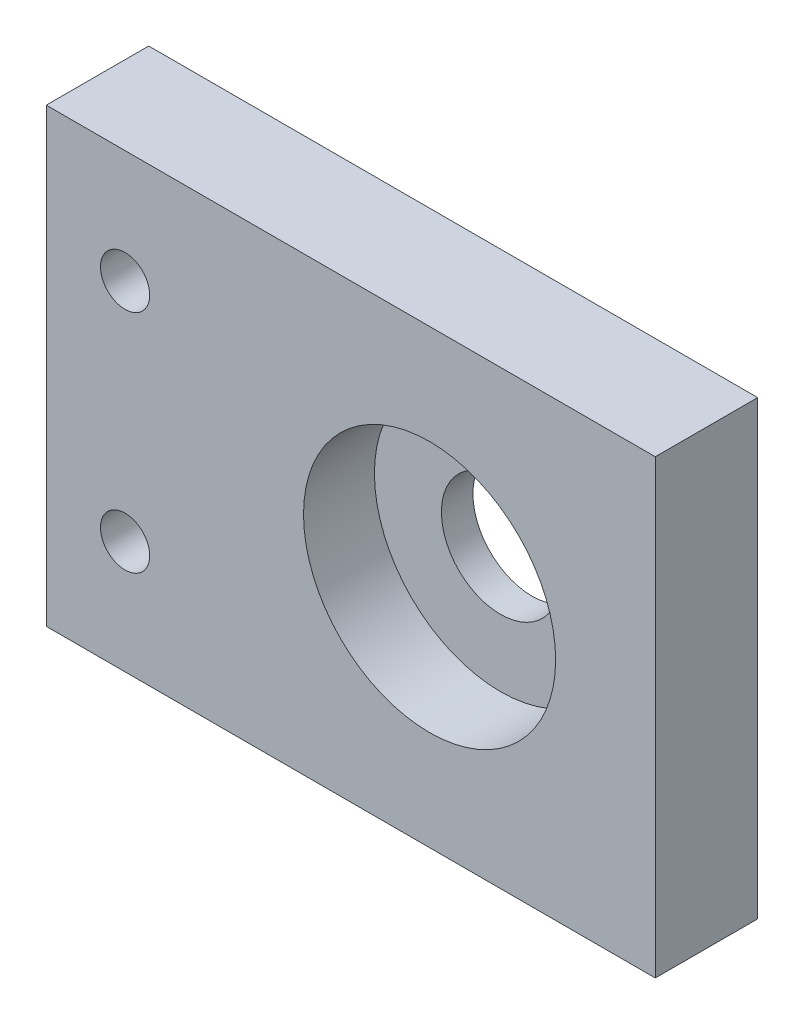
ISO-10303-21;
HEADER;
FILE_DESCRIPTION(('STEP AP214'),'2;1');
FILE_NAME('part.step','',(''),(''),'','','');
FILE_SCHEMA(('AUTOMOTIVE_DESIGN { 1 0 10303 214 1 1 1 1 }'));
ENDSEC;
DATA;
#1=APPLICATION_CONTEXT('core data for automotive mechanical design processes');
#2=APPLICATION_PROTOCOL_DEFINITION('international standard','automotive_design',2000,#1);
#3=PRODUCT_CONTEXT('',#1,'mechanical');
#4=PRODUCT('Part','Part','',(#3));
#5=PRODUCT_RELATED_PRODUCT_CATEGORY('part','',(#4));
#6=PRODUCT_DEFINITION_FORMATION('','',#4);
#7=PRODUCT_DEFINITION_CONTEXT('part definition',#1,'design');
#8=PRODUCT_DEFINITION('design','',#6,#7);
#9=PRODUCT_DEFINITION_SHAPE('','',#8);
#10=(LENGTH_UNIT() NAMED_UNIT(*) SI_UNIT(.MILLI.,.METRE.));
#11=(NAMED_UNIT(*) PLANE_ANGLE_UNIT() SI_UNIT($,.RADIAN.));
#12=(NAMED_UNIT(*) SI_UNIT($,.STERADIAN.) SOLID_ANGLE_UNIT());
#13=UNCERTAINTY_MEASURE_WITH_UNIT(LENGTH_MEASURE(1.E-05),#10,'distance_accuracy_value','');
#14=(GEOMETRIC_REPRESENTATION_CONTEXT(3) GLOBAL_UNCERTAINTY_ASSIGNED_CONTEXT((#13)) GLOBAL_UNIT_ASSIGNED_CONTEXT((#10,
#11,#12)) REPRESENTATION_CONTEXT('',''));
#15=CARTESIAN_POINT('',(0.,0.,0.));
#16=DIRECTION('',(0.,0.,1.));
#17=DIRECTION('',(1.,0.,0.));
#18=AXIS2_PLACEMENT_3D('',#15,#16,#17);
#19=CARTESIAN_POINT('',(38.65,-28.65,13.));
#20=DIRECTION('',(-1.,0.,0.));
#21=DIRECTION('',(0.,0.,1.));
#22=AXIS2_PLACEMENT_3D('',#19,#20,#21);
#23=PLANE('',#22);
#24=DIRECTION('',(0.,1.,0.));
#25=VECTOR('',#24,1.);
#26=CARTESIAN_POINT('',(38.65,-28.65,0.));
#27=LINE('',#26,#25);
#28=CARTESIAN_POINT('',(38.65,-28.65,0.));
#29=VERTEX_POINT('',#28);
#30=CARTESIAN_POINT('',(38.65,28.65,0.));
#31=VERTEX_POINT('',#30);
#32=EDGE_CURVE('E109',#29,#31,#27,.T.);
#33=ORIENTED_EDGE('',*,*,#32,.T.);
#34=DIRECTION('',(0.,0.,-1.));
#35=VECTOR('',#34,1.);
#36=CARTESIAN_POINT('',(38.65,28.65,13.));
#37=LINE('',#36,#35);
#38=CARTESIAN_POINT('',(38.65,28.65,13.));
#39=VERTEX_POINT('',#38);
#40=EDGE_CURVE('E11',#39,#31,#37,.T.);
#41=ORIENTED_EDGE('',*,*,#40,.F.);
#42=DIRECTION('',(0.,1.,0.));
#43=VECTOR('',#42,1.);
#44=CARTESIAN_POINT('',(38.65,-28.65,13.));
#45=LINE('',#44,#43);
#46=CARTESIAN_POINT('',(38.65,-28.65,13.));
#47=VERTEX_POINT('',#46);
#48=EDGE_CURVE('E92',#47,#39,#45,.T.);
#49=ORIENTED_EDGE('',*,*,#48,.F.);
#50=DIRECTION('',(0.,0.,-1.));
#51=VECTOR('',#50,1.);
#52=CARTESIAN_POINT('',(38.65,-28.65,13.));
#53=LINE('',#52,#51);
#54=EDGE_CURVE('E105',#47,#29,#53,.T.);
#55=ORIENTED_EDGE('',*,*,#54,.T.);
#56=EDGE_LOOP('',(#33,#41,#49,#55));
#57=FACE_BOUND('',#56,.T.);
#58=ADVANCED_FACE('F39',(#57),#23,.F.);
#59=CARTESIAN_POINT('',(-38.65,28.65,13.));
#60=DIRECTION('',(0.,-1.,0.));
#61=DIRECTION('',(0.,0.,-1.));
#62=AXIS2_PLACEMENT_3D('',#59,#60,#61);
#63=PLANE('',#62);
#64=DIRECTION('',(-1.,0.,0.));
#65=VECTOR('',#64,1.);
#66=CARTESIAN_POINT('',(-38.65,28.65,0.));
#67=LINE('',#66,#65);
#68=CARTESIAN_POINT('',(-38.65,28.65,0.));
#69=VERTEX_POINT('',#68);
#70=EDGE_CURVE('E97',#31,#69,#67,.T.);
#71=ORIENTED_EDGE('',*,*,#70,.T.);
#72=DIRECTION('',(0.,0.,-1.));
#73=VECTOR('',#72,1.);
#74=CARTESIAN_POINT('',(-38.65,28.65,13.));
#75=LINE('',#74,#73);
#76=CARTESIAN_POINT('',(-38.65,28.65,13.));
#77=VERTEX_POINT('',#76);
#78=EDGE_CURVE('E49',#77,#69,#75,.T.);
#79=ORIENTED_EDGE('',*,*,#78,.F.);
#80=DIRECTION('',(-1.,0.,0.));
#81=VECTOR('',#80,1.);
#82=CARTESIAN_POINT('',(-38.65,28.65,13.));
#83=LINE('',#82,#81);
#84=EDGE_CURVE('E87',#39,#77,#83,.T.);
#85=ORIENTED_EDGE('',*,*,#84,.F.);
#86=ORIENTED_EDGE('',*,*,#40,.T.);
#87=EDGE_LOOP('',(#71,#79,#85,#86));
#88=FACE_BOUND('',#87,.T.);
#89=ADVANCED_FACE('F96',(#88),#63,.F.);
#90=CARTESIAN_POINT('',(-38.65,-28.65,13.));
#91=DIRECTION('',(1.,0.,0.));
#92=DIRECTION('',(0.,0.,-1.));
#93=AXIS2_PLACEMENT_3D('',#90,#91,#92);
#94=PLANE('',#93);
#95=DIRECTION('',(0.,-1.,0.));
#96=VECTOR('',#95,1.);
#97=CARTESIAN_POINT('',(-38.65,-28.65,0.));
#98=LINE('',#97,#96);
#99=CARTESIAN_POINT('',(-38.65,-28.65,0.));
#100=VERTEX_POINT('',#99);
#101=EDGE_CURVE('E74',#69,#100,#98,.T.);
#102=ORIENTED_EDGE('',*,*,#101,.T.);
#103=DIRECTION('',(0.,0.,-1.));
#104=VECTOR('',#103,1.);
#105=CARTESIAN_POINT('',(-38.65,-28.65,13.));
#106=LINE('',#105,#104);
#107=CARTESIAN_POINT('',(-38.65,-28.65,13.));
#108=VERTEX_POINT('',#107);
#109=EDGE_CURVE('E99',#108,#100,#106,.T.);
#110=ORIENTED_EDGE('',*,*,#109,.F.);
#111=DIRECTION('',(0.,-1.,0.));
#112=VECTOR('',#111,1.);
#113=CARTESIAN_POINT('',(-38.65,-28.65,13.));
#114=LINE('',#113,#112);
#115=EDGE_CURVE('E90',#77,#108,#114,.T.);
#116=ORIENTED_EDGE('',*,*,#115,.F.);
#117=ORIENTED_EDGE('',*,*,#78,.T.);
#118=EDGE_LOOP('',(#102,#110,#116,#117));
#119=FACE_BOUND('',#118,.T.);
#120=ADVANCED_FACE('F101',(#119),#94,.F.);
#121=CARTESIAN_POINT('',(-38.65,-28.65,13.));
#122=DIRECTION('',(0.,1.,0.));
#123=DIRECTION('',(0.,0.,1.));
#124=AXIS2_PLACEMENT_3D('',#121,#122,#123);
#125=PLANE('',#124);
#126=DIRECTION('',(1.,0.,0.));
#127=VECTOR('',#126,1.);
#128=CARTESIAN_POINT('',(-38.65,-28.65,0.));
#129=LINE('',#128,#127);
#130=EDGE_CURVE('E80',#100,#29,#129,.T.);
#131=ORIENTED_EDGE('',*,*,#130,.T.);
#132=ORIENTED_EDGE('',*,*,#54,.F.);
#133=DIRECTION('',(1.,0.,0.));
#134=VECTOR('',#133,1.);
#135=CARTESIAN_POINT('',(-38.65,-28.65,13.));
#136=LINE('',#135,#134);
#137=EDGE_CURVE('E57',#108,#47,#136,.T.);
#138=ORIENTED_EDGE('',*,*,#137,.F.);
#139=ORIENTED_EDGE('',*,*,#109,.T.);
#140=EDGE_LOOP('',(#131,#132,#138,#139));
#141=FACE_BOUND('',#140,.T.);
#142=ADVANCED_FACE('F123',(#141),#125,.F.);
#143=CARTESIAN_POINT('',(0.,0.,13.));
#144=DIRECTION('',(0.,0.,-1.));
#145=DIRECTION('',(-1.,0.,0.));
#146=AXIS2_PLACEMENT_3D('',#143,#144,#145);
#147=PLANE('',#146);
#148=CARTESIAN_POINT('',(10.,0.,13.));
#149=DIRECTION('',(0.,0.,1.));
#150=DIRECTION('',(1.,0.,0.));
#151=AXIS2_PLACEMENT_3D('',#148,#149,#150);
#152=CIRCLE('',#151,16.);
#153=CARTESIAN_POINT('',(26.,0.,13.));
#154=VERTEX_POINT('',#153);
#155=EDGE_CURVE('E146',#154,#154,#152,.T.);
#156=ORIENTED_EDGE('',*,*,#155,.F.);
#157=EDGE_LOOP('',(#156));
#158=FACE_BOUND('',#157,.T.);
#159=CARTESIAN_POINT('',(-28.65,14.325,13.));
#160=DIRECTION('',(0.,0.,1.));
#161=DIRECTION('',(1.,0.,0.));
#162=AXIS2_PLACEMENT_3D('',#159,#160,#161);
#163=CIRCLE('',#162,3.12499999999999);
#164=CARTESIAN_POINT('',(-25.525,14.325,13.));
#165=VERTEX_POINT('',#164);
#166=EDGE_CURVE('E141',#165,#165,#163,.T.);
#167=ORIENTED_EDGE('',*,*,#166,.F.);
#168=EDGE_LOOP('',(#167));
#169=FACE_BOUND('',#168,.T.);
#170=CARTESIAN_POINT('',(-28.65,-14.325,13.));
#171=DIRECTION('',(0.,0.,1.));
#172=DIRECTION('',(1.,0.,0.));
#173=AXIS2_PLACEMENT_3D('',#170,#171,#172);
#174=CIRCLE('',#173,3.12499999999999);
#175=CARTESIAN_POINT('',(-25.525,-14.325,13.));
#176=VERTEX_POINT('',#175);
#177=EDGE_CURVE('E133',#176,#176,#174,.T.);
#178=ORIENTED_EDGE('',*,*,#177,.F.);
#179=EDGE_LOOP('',(#178));
#180=FACE_BOUND('',#179,.T.);
#181=ORIENTED_EDGE('',*,*,#48,.T.);
#182=ORIENTED_EDGE('',*,*,#84,.T.);
#183=ORIENTED_EDGE('',*,*,#115,.T.);
#184=ORIENTED_EDGE('',*,*,#137,.T.);
#185=EDGE_LOOP('',(#181,#182,#183,#184));
#186=FACE_BOUND('',#185,.T.);
#187=ADVANCED_FACE('F88',(#158,#169,#180,#186),#147,.F.);
#188=CARTESIAN_POINT('',(0.,0.,0.));
#189=DIRECTION('',(0.,0.,-1.));
#190=DIRECTION('',(-1.,0.,0.));
#191=AXIS2_PLACEMENT_3D('',#188,#189,#190);
#192=PLANE('',#191);
#193=CARTESIAN_POINT('',(10.,0.,0.));
#194=DIRECTION('',(0.,0.,-1.));
#195=DIRECTION('',(-1.,0.,0.));
#196=AXIS2_PLACEMENT_3D('',#193,#194,#195);
#197=CIRCLE('',#196,7.5);
#198=CARTESIAN_POINT('',(2.50000000000001,0.,0.));
#199=VERTEX_POINT('',#198);
#200=EDGE_CURVE('E42',#199,#199,#197,.T.);
#201=ORIENTED_EDGE('',*,*,#200,.F.);
#202=EDGE_LOOP('',(#201));
#203=FACE_BOUND('',#202,.T.);
#204=CARTESIAN_POINT('',(-28.65,14.325,0.));
#205=DIRECTION('',(0.,0.,-1.));
#206=DIRECTION('',(-1.,0.,0.));
#207=AXIS2_PLACEMENT_3D('',#204,#205,#206);
#208=CIRCLE('',#207,3.12499999999999);
#209=CARTESIAN_POINT('',(-31.775,14.325,0.));
#210=VERTEX_POINT('',#209);
#211=EDGE_CURVE('E137',#210,#210,#208,.T.);
#212=ORIENTED_EDGE('',*,*,#211,.F.);
#213=EDGE_LOOP('',(#212));
#214=FACE_BOUND('',#213,.T.);
#215=CARTESIAN_POINT('',(-28.65,-14.325,0.));
#216=DIRECTION('',(0.,0.,-1.));
#217=DIRECTION('',(-1.,0.,0.));
#218=AXIS2_PLACEMENT_3D('',#215,#216,#217);
#219=CIRCLE('',#218,3.12499999999999);
#220=CARTESIAN_POINT('',(-31.775,-14.325,0.));
#221=VERTEX_POINT('',#220);
#222=EDGE_CURVE('E113',#221,#221,#219,.T.);
#223=ORIENTED_EDGE('',*,*,#222,.F.);
#224=EDGE_LOOP('',(#223));
#225=FACE_BOUND('',#224,.T.);
#226=ORIENTED_EDGE('',*,*,#32,.F.);
#227=ORIENTED_EDGE('',*,*,#130,.F.);
#228=ORIENTED_EDGE('',*,*,#101,.F.);
#229=ORIENTED_EDGE('',*,*,#70,.F.);
#230=EDGE_LOOP('',(#226,#227,#228,#229));
#231=FACE_BOUND('',#230,.T.);
#232=ADVANCED_FACE('F126',(#203,#214,#225,#231),#192,.T.);
#233=CARTESIAN_POINT('',(-28.65,-14.325,13.));
#234=DIRECTION('',(0.,0.,1.));
#235=DIRECTION('',(1.,0.,0.));
#236=AXIS2_PLACEMENT_3D('',#233,#234,#235);
#237=CYLINDRICAL_SURFACE('',#236,3.12499999999999);
#238=ORIENTED_EDGE('',*,*,#222,.T.);
#239=EDGE_LOOP('',(#238));
#240=FACE_BOUND('',#239,.T.);
#241=ORIENTED_EDGE('',*,*,#177,.T.);
#242=EDGE_LOOP('',(#241));
#243=FACE_BOUND('',#242,.T.);
#244=ADVANCED_FACE('F166',(#240,#243),#237,.F.);
#245=CARTESIAN_POINT('',(-28.65,14.325,13.));
#246=DIRECTION('',(0.,0.,1.));
#247=DIRECTION('',(1.,0.,0.));
#248=AXIS2_PLACEMENT_3D('',#245,#246,#247);
#249=CYLINDRICAL_SURFACE('',#248,3.12499999999999);
#250=ORIENTED_EDGE('',*,*,#211,.T.);
#251=EDGE_LOOP('',(#250));
#252=FACE_BOUND('',#251,.T.);
#253=ORIENTED_EDGE('',*,*,#166,.T.);
#254=EDGE_LOOP('',(#253));
#255=FACE_BOUND('',#254,.T.);
#256=ADVANCED_FACE('F174',(#252,#255),#249,.F.);
#257=CARTESIAN_POINT('',(10.,0.,4.));
#258=DIRECTION('',(0.,0.,1.));
#259=DIRECTION('',(1.,0.,0.));
#260=AXIS2_PLACEMENT_3D('',#257,#258,#259);
#261=CYLINDRICAL_SURFACE('',#260,16.);
#262=CARTESIAN_POINT('',(10.,0.,4.));
#263=DIRECTION('',(0.,0.,1.));
#264=DIRECTION('',(1.,0.,0.));
#265=AXIS2_PLACEMENT_3D('',#262,#263,#264);
#266=CIRCLE('',#265,16.);
#267=CARTESIAN_POINT('',(26.,0.,4.));
#268=VERTEX_POINT('',#267);
#269=EDGE_CURVE('E145',#268,#268,#266,.T.);
#270=ORIENTED_EDGE('',*,*,#269,.F.);
#271=EDGE_LOOP('',(#270));
#272=FACE_BOUND('',#271,.T.);
#273=ORIENTED_EDGE('',*,*,#155,.T.);
#274=EDGE_LOOP('',(#273));
#275=FACE_BOUND('',#274,.T.);
#276=ADVANCED_FACE('F217',(#272,#275),#261,.F.);
#277=CARTESIAN_POINT('',(10.,0.,4.));
#278=DIRECTION('',(0.,0.,1.));
#279=DIRECTION('',(1.,0.,0.));
#280=AXIS2_PLACEMENT_3D('',#277,#278,#279);
#281=PLANE('',#280);
#282=CARTESIAN_POINT('',(10.,0.,4.));
#283=DIRECTION('',(0.,0.,1.));
#284=DIRECTION('',(1.,0.,0.));
#285=AXIS2_PLACEMENT_3D('',#282,#283,#284);
#286=CIRCLE('',#285,7.5);
#287=CARTESIAN_POINT('',(17.5,0.,4.));
#288=VERTEX_POINT('',#287);
#289=EDGE_CURVE('E153',#288,#288,#286,.T.);
#290=ORIENTED_EDGE('',*,*,#289,.F.);
#291=EDGE_LOOP('',(#290));
#292=FACE_BOUND('',#291,.T.);
#293=ORIENTED_EDGE('',*,*,#269,.T.);
#294=EDGE_LOOP('',(#293));
#295=FACE_BOUND('',#294,.T.);
#296=ADVANCED_FACE('F231',(#292,#295),#281,.T.);
#297=CARTESIAN_POINT('',(10.,0.,-5.));
#298=DIRECTION('',(0.,0.,1.));
#299=DIRECTION('',(1.,0.,0.));
#300=AXIS2_PLACEMENT_3D('',#297,#298,#299);
#301=CYLINDRICAL_SURFACE('',#300,7.5);
#302=ORIENTED_EDGE('',*,*,#200,.T.);
#303=EDGE_LOOP('',(#302));
#304=FACE_BOUND('',#303,.T.);
#305=ORIENTED_EDGE('',*,*,#289,.T.);
#306=EDGE_LOOP('',(#305));
#307=FACE_BOUND('',#306,.T.);
#308=ADVANCED_FACE('F162',(#304,#307),#301,.F.);
#309=CLOSED_SHELL('',(#58,#89,#120,#142,#187,#232,#244,#256,#276,#296,#308));
#310=MANIFOLD_SOLID_BREP('B2',#309);
#311=ADVANCED_BREP_SHAPE_REPRESENTATION('',(#18,#310),#14);
#312=SHAPE_DEFINITION_REPRESENTATION(#9,#311);
ENDSEC;
END-ISO-10303-21;
